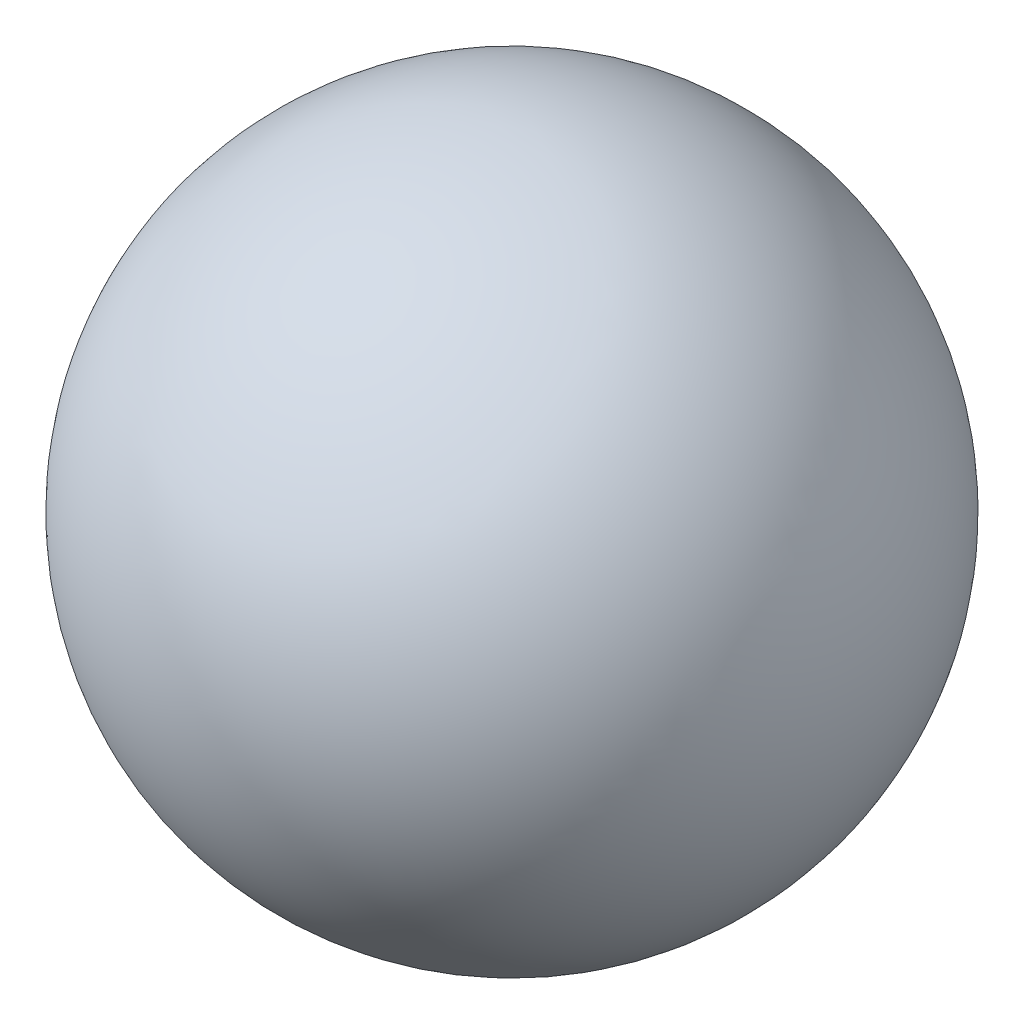
ISO-10303-21;
HEADER;
FILE_DESCRIPTION(('STEP AP214'),'2;1');
FILE_NAME('part.step','',(''),(''),'','','');
FILE_SCHEMA(('AUTOMOTIVE_DESIGN { 1 0 10303 214 1 1 1 1 }'));
ENDSEC;
DATA;
#1=APPLICATION_CONTEXT('core data for automotive mechanical design processes');
#2=APPLICATION_PROTOCOL_DEFINITION('international standard','automotive_design',2000,#1);
#3=PRODUCT_CONTEXT('',#1,'mechanical');
#4=PRODUCT('Part','Part','',(#3));
#5=PRODUCT_RELATED_PRODUCT_CATEGORY('part','',(#4));
#6=PRODUCT_DEFINITION_FORMATION('','',#4);
#7=PRODUCT_DEFINITION_CONTEXT('part definition',#1,'design');
#8=PRODUCT_DEFINITION('design','',#6,#7);
#9=PRODUCT_DEFINITION_SHAPE('','',#8);
#10=(LENGTH_UNIT() NAMED_UNIT(*) SI_UNIT(.MILLI.,.METRE.));
#11=(NAMED_UNIT(*) PLANE_ANGLE_UNIT() SI_UNIT($,.RADIAN.));
#12=(NAMED_UNIT(*) SI_UNIT($,.STERADIAN.) SOLID_ANGLE_UNIT());
#13=UNCERTAINTY_MEASURE_WITH_UNIT(LENGTH_MEASURE(1.E-05),#10,'distance_accuracy_value','');
#14=(GEOMETRIC_REPRESENTATION_CONTEXT(3) GLOBAL_UNCERTAINTY_ASSIGNED_CONTEXT((#13)) GLOBAL_UNIT_ASSIGNED_CONTEXT((#10,
#11,#12)) REPRESENTATION_CONTEXT('',''));
#15=CARTESIAN_POINT('',(0.,0.,0.));
#16=DIRECTION('',(0.,0.,1.));
#17=DIRECTION('',(1.,0.,0.));
#18=AXIS2_PLACEMENT_3D('',#15,#16,#17);
#19=CARTESIAN_POINT('',(0.,5.99999999999934,2.));
#20=DIRECTION('',(1.,0.,0.));
#21=DIRECTION('',(0.,0.,-1.));
#22=AXIS2_PLACEMENT_3D('',#19,#20,#21);
#23=SPHERICAL_SURFACE('',#22,1.04);
#24=CARTESIAN_POINT('',(-1.03999999999993,5.99999999999935,2.));
#25=VERTEX_POINT('',#24);
#26=VERTEX_LOOP('',#25);
#27=FACE_BOUND('',#26,.T.);
#28=ADVANCED_FACE('F15',(#27),#23,.T.);
#29=CLOSED_SHELL('',(#28));
#30=MANIFOLD_SOLID_BREP('B1',#29);
#31=ADVANCED_BREP_SHAPE_REPRESENTATION('',(#18,#30),#14);
#32=SHAPE_DEFINITION_REPRESENTATION(#9,#31);
ENDSEC;
END-ISO-10303-21;
